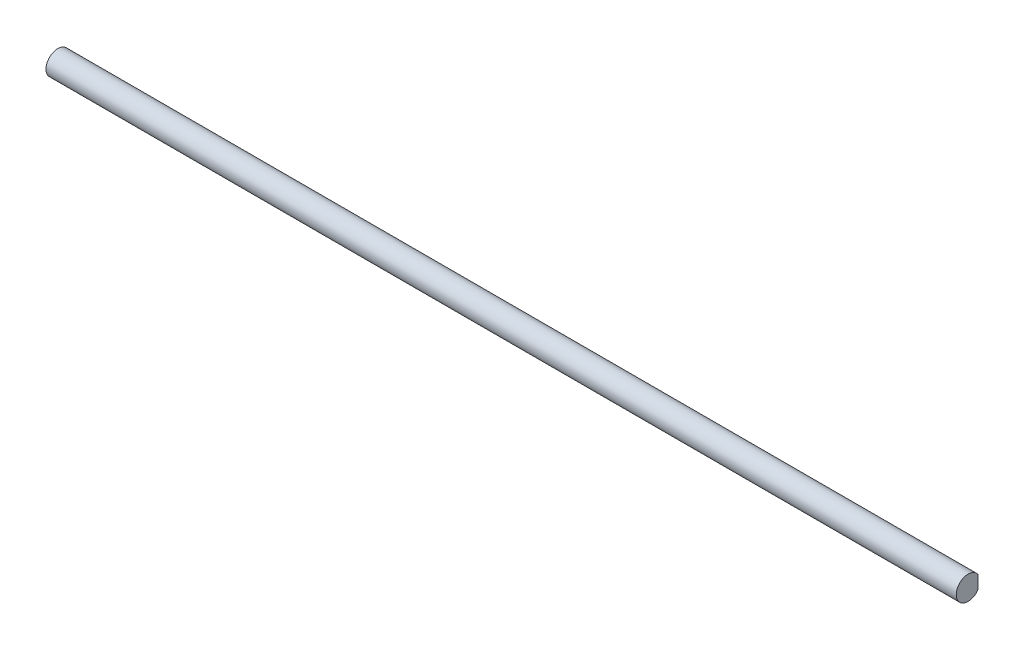
ISO-10303-21;
HEADER;
FILE_DESCRIPTION(('STEP AP214'),'2;1');
FILE_NAME('part.step','',(''),(''),'','','');
FILE_SCHEMA(('AUTOMOTIVE_DESIGN { 1 0 10303 214 1 1 1 1 }'));
ENDSEC;
DATA;
#1=APPLICATION_CONTEXT('core data for automotive mechanical design processes');
#2=APPLICATION_PROTOCOL_DEFINITION('international standard','automotive_design',2000,#1);
#3=PRODUCT_CONTEXT('',#1,'mechanical');
#4=PRODUCT('Part','Part','',(#3));
#5=PRODUCT_RELATED_PRODUCT_CATEGORY('part','',(#4));
#6=PRODUCT_DEFINITION_FORMATION('','',#4);
#7=PRODUCT_DEFINITION_CONTEXT('part definition',#1,'design');
#8=PRODUCT_DEFINITION('design','',#6,#7);
#9=PRODUCT_DEFINITION_SHAPE('','',#8);
#10=(LENGTH_UNIT() NAMED_UNIT(*) SI_UNIT(.MILLI.,.METRE.));
#11=(NAMED_UNIT(*) PLANE_ANGLE_UNIT() SI_UNIT($,.RADIAN.));
#12=(NAMED_UNIT(*) SI_UNIT($,.STERADIAN.) SOLID_ANGLE_UNIT());
#13=UNCERTAINTY_MEASURE_WITH_UNIT(LENGTH_MEASURE(1.E-05),#10,'distance_accuracy_value','');
#14=(GEOMETRIC_REPRESENTATION_CONTEXT(3) GLOBAL_UNCERTAINTY_ASSIGNED_CONTEXT((#13)) GLOBAL_UNIT_ASSIGNED_CONTEXT((#10,
#11,#12)) REPRESENTATION_CONTEXT('',''));
#15=CARTESIAN_POINT('',(0.,0.,0.));
#16=DIRECTION('',(0.,0.,1.));
#17=DIRECTION('',(1.,0.,0.));
#18=AXIS2_PLACEMENT_3D('',#15,#16,#17);
#19=CARTESIAN_POINT('',(460.,0.,0.));
#20=DIRECTION('',(-1.,0.,0.));
#21=DIRECTION('',(0.,0.,1.));
#22=AXIS2_PLACEMENT_3D('',#19,#20,#21);
#23=CYLINDRICAL_SURFACE('',#22,6.);
#24=CARTESIAN_POINT('',(15.5,0.,0.));
#25=DIRECTION('',(1.,0.,0.));
#26=DIRECTION('',(0.,0.,-1.));
#27=AXIS2_PLACEMENT_3D('',#24,#25,#26);
#28=CIRCLE('',#27,6.);
#29=CARTESIAN_POINT('',(15.5,-3.3166247903553,-5.));
#30=VERTEX_POINT('',#29);
#31=CARTESIAN_POINT('',(15.5,3.3166247903553,-5.));
#32=VERTEX_POINT('',#31);
#33=EDGE_CURVE('E120',#30,#32,#28,.T.);
#34=ORIENTED_EDGE('',*,*,#33,.T.);
#35=DIRECTION('',(-1.,0.,0.));
#36=VECTOR('',#35,1.);
#37=CARTESIAN_POINT('',(460.,3.31662479035529,-5.00000000000007));
#38=LINE('',#37,#36);
#39=CARTESIAN_POINT('',(0.,3.31662479035541,-5.));
#40=VERTEX_POINT('',#39);
#41=EDGE_CURVE('E107',#32,#40,#38,.T.);
#42=ORIENTED_EDGE('',*,*,#41,.T.);
#43=CARTESIAN_POINT('',(0.,0.,0.));
#44=DIRECTION('',(1.,0.,0.));
#45=DIRECTION('',(0.,0.,-1.));
#46=AXIS2_PLACEMENT_3D('',#43,#44,#45);
#47=CIRCLE('',#46,6.);
#48=CARTESIAN_POINT('',(0.,-3.3166247903554,-5.));
#49=VERTEX_POINT('',#48);
#50=EDGE_CURVE('E111',#40,#49,#47,.T.);
#51=ORIENTED_EDGE('',*,*,#50,.T.);
#52=DIRECTION('',(-1.,0.,0.));
#53=VECTOR('',#52,1.);
#54=CARTESIAN_POINT('',(460.,-3.31662479035529,-5.00000000000007));
#55=LINE('',#54,#53);
#56=EDGE_CURVE('E66',#49,#30,#55,.F.);
#57=ORIENTED_EDGE('',*,*,#56,.T.);
#58=EDGE_LOOP('',(#34,#42,#51,#57));
#59=FACE_BOUND('',#58,.T.);
#60=DIRECTION('',(-1.,0.,0.));
#61=VECTOR('',#60,1.);
#62=CARTESIAN_POINT('',(460.,3.3166247903554,-5.));
#63=LINE('',#62,#61);
#64=CARTESIAN_POINT('',(444.5,3.3166247903554,-5.));
#65=VERTEX_POINT('',#64);
#66=CARTESIAN_POINT('',(460.,3.3166247903554,-5.));
#67=VERTEX_POINT('',#66);
#68=EDGE_CURVE('E58',#65,#67,#63,.F.);
#69=ORIENTED_EDGE('',*,*,#68,.F.);
#70=CARTESIAN_POINT('',(444.5,0.,0.));
#71=DIRECTION('',(1.,0.,0.));
#72=DIRECTION('',(0.,0.,-1.));
#73=AXIS2_PLACEMENT_3D('',#70,#71,#72);
#74=CIRCLE('',#73,6.);
#75=CARTESIAN_POINT('',(444.5,-3.3166247903554,-5.));
#76=VERTEX_POINT('',#75);
#77=EDGE_CURVE('E11',#76,#65,#74,.T.);
#78=ORIENTED_EDGE('',*,*,#77,.F.);
#79=DIRECTION('',(-1.,0.,0.));
#80=VECTOR('',#79,1.);
#81=CARTESIAN_POINT('',(460.,-3.3166247903554,-5.));
#82=LINE('',#81,#80);
#83=CARTESIAN_POINT('',(460.,-3.31662479035541,-5.));
#84=VERTEX_POINT('',#83);
#85=EDGE_CURVE('E83',#84,#76,#82,.T.);
#86=ORIENTED_EDGE('',*,*,#85,.F.);
#87=CARTESIAN_POINT('',(460.,0.,0.));
#88=DIRECTION('',(1.,0.,0.));
#89=DIRECTION('',(0.,0.,-1.));
#90=AXIS2_PLACEMENT_3D('',#87,#88,#89);
#91=CIRCLE('',#90,6.);
#92=EDGE_CURVE('E98',#67,#84,#91,.T.);
#93=ORIENTED_EDGE('',*,*,#92,.F.);
#94=EDGE_LOOP('',(#69,#78,#86,#93));
#95=FACE_BOUND('',#94,.T.);
#96=ADVANCED_FACE('F43',(#59,#95),#23,.T.);
#97=CARTESIAN_POINT('',(460.,0.,0.));
#98=DIRECTION('',(1.,0.,0.));
#99=DIRECTION('',(0.,0.,-1.));
#100=AXIS2_PLACEMENT_3D('',#97,#98,#99);
#101=PLANE('',#100);
#102=ORIENTED_EDGE('',*,*,#92,.T.);
#103=DIRECTION('',(0.,1.,0.));
#104=VECTOR('',#103,1.);
#105=CARTESIAN_POINT('',(460.,0.,-5.));
#106=LINE('',#105,#104);
#107=EDGE_CURVE('E51',#84,#67,#106,.T.);
#108=ORIENTED_EDGE('',*,*,#107,.T.);
#109=EDGE_LOOP('',(#102,#108));
#110=FACE_BOUND('',#109,.T.);
#111=ADVANCED_FACE('F124',(#110),#101,.T.);
#112=CARTESIAN_POINT('',(0.,0.,0.));
#113=DIRECTION('',(1.,0.,0.));
#114=DIRECTION('',(0.,0.,-1.));
#115=AXIS2_PLACEMENT_3D('',#112,#113,#114);
#116=PLANE('',#115);
#117=ORIENTED_EDGE('',*,*,#50,.F.);
#118=DIRECTION('',(0.,-1.,0.));
#119=VECTOR('',#118,1.);
#120=CARTESIAN_POINT('',(0.,0.,-5.));
#121=LINE('',#120,#119);
#122=EDGE_CURVE('E114',#40,#49,#121,.T.);
#123=ORIENTED_EDGE('',*,*,#122,.T.);
#124=EDGE_LOOP('',(#117,#123));
#125=FACE_BOUND('',#124,.T.);
#126=ADVANCED_FACE('F126',(#125),#116,.F.);
#127=CARTESIAN_POINT('',(15.5,-200.,-6.));
#128=DIRECTION('',(1.,0.,0.));
#129=DIRECTION('',(0.,0.,-1.));
#130=AXIS2_PLACEMENT_3D('',#127,#128,#129);
#131=PLANE('',#130);
#132=ORIENTED_EDGE('',*,*,#33,.F.);
#133=DIRECTION('',(0.,1.,0.));
#134=VECTOR('',#133,1.);
#135=CARTESIAN_POINT('',(15.5,-200.,-5.));
#136=LINE('',#135,#134);
#137=EDGE_CURVE('E92',#30,#32,#136,.T.);
#138=ORIENTED_EDGE('',*,*,#137,.T.);
#139=EDGE_LOOP('',(#132,#138));
#140=FACE_BOUND('',#139,.T.);
#141=ADVANCED_FACE('F132',(#140),#131,.F.);
#142=CARTESIAN_POINT('',(15.5,-200.,-5.));
#143=DIRECTION('',(0.,0.,1.));
#144=DIRECTION('',(1.,0.,0.));
#145=AXIS2_PLACEMENT_3D('',#142,#143,#144);
#146=PLANE('',#145);
#147=ORIENTED_EDGE('',*,*,#137,.F.);
#148=ORIENTED_EDGE('',*,*,#56,.F.);
#149=ORIENTED_EDGE('',*,*,#122,.F.);
#150=ORIENTED_EDGE('',*,*,#41,.F.);
#151=EDGE_LOOP('',(#147,#148,#149,#150));
#152=FACE_BOUND('',#151,.T.);
#153=ADVANCED_FACE('F136',(#152),#146,.F.);
#154=CARTESIAN_POINT('',(444.5,-200.,-6.));
#155=DIRECTION('',(1.,0.,0.));
#156=DIRECTION('',(0.,0.,-1.));
#157=AXIS2_PLACEMENT_3D('',#154,#155,#156);
#158=PLANE('',#157);
#159=ORIENTED_EDGE('',*,*,#77,.T.);
#160=DIRECTION('',(0.,1.,0.));
#161=VECTOR('',#160,1.);
#162=CARTESIAN_POINT('',(444.5,-200.,-5.));
#163=LINE('',#162,#161);
#164=EDGE_CURVE('E86',#76,#65,#163,.T.);
#165=ORIENTED_EDGE('',*,*,#164,.F.);
#166=EDGE_LOOP('',(#159,#165));
#167=FACE_BOUND('',#166,.T.);
#168=ADVANCED_FACE('F95',(#167),#158,.T.);
#169=CARTESIAN_POINT('',(444.5,-200.,-5.));
#170=DIRECTION('',(0.,0.,-1.));
#171=DIRECTION('',(-1.,0.,0.));
#172=AXIS2_PLACEMENT_3D('',#169,#170,#171);
#173=PLANE('',#172);
#174=ORIENTED_EDGE('',*,*,#85,.T.);
#175=ORIENTED_EDGE('',*,*,#164,.T.);
#176=ORIENTED_EDGE('',*,*,#68,.T.);
#177=ORIENTED_EDGE('',*,*,#107,.F.);
#178=EDGE_LOOP('',(#174,#175,#176,#177));
#179=FACE_BOUND('',#178,.T.);
#180=ADVANCED_FACE('F85',(#179),#173,.T.);
#181=CLOSED_SHELL('',(#96,#111,#126,#141,#153,#168,#180));
#182=MANIFOLD_SOLID_BREP('B2',#181);
#183=ADVANCED_BREP_SHAPE_REPRESENTATION('',(#18,#182),#14);
#184=SHAPE_DEFINITION_REPRESENTATION(#9,#183);
ENDSEC;
END-ISO-10303-21;
